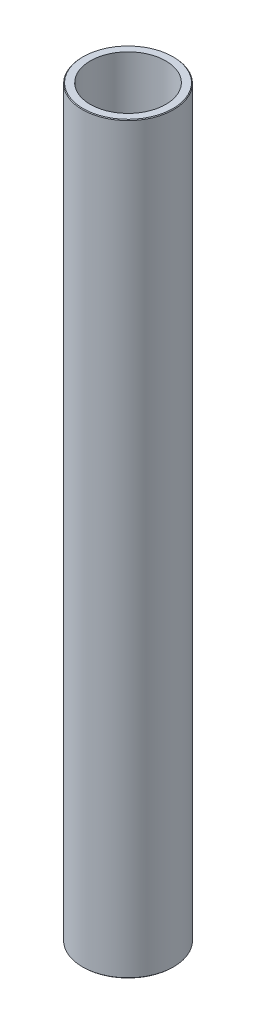
ISO-10303-21;
HEADER;
FILE_DESCRIPTION(('STEP AP214'),'2;1');
FILE_NAME('part.step','',(''),(''),'','','');
FILE_SCHEMA(('AUTOMOTIVE_DESIGN { 1 0 10303 214 1 1 1 1 }'));
ENDSEC;
DATA;
#1=APPLICATION_CONTEXT('core data for automotive mechanical design processes');
#2=APPLICATION_PROTOCOL_DEFINITION('international standard','automotive_design',2000,#1);
#3=PRODUCT_CONTEXT('',#1,'mechanical');
#4=PRODUCT('Part','Part','',(#3));
#5=PRODUCT_RELATED_PRODUCT_CATEGORY('part','',(#4));
#6=PRODUCT_DEFINITION_FORMATION('','',#4);
#7=PRODUCT_DEFINITION_CONTEXT('part definition',#1,'design');
#8=PRODUCT_DEFINITION('design','',#6,#7);
#9=PRODUCT_DEFINITION_SHAPE('','',#8);
#10=(LENGTH_UNIT() NAMED_UNIT(*) SI_UNIT(.MILLI.,.METRE.));
#11=(NAMED_UNIT(*) PLANE_ANGLE_UNIT() SI_UNIT($,.RADIAN.));
#12=(NAMED_UNIT(*) SI_UNIT($,.STERADIAN.) SOLID_ANGLE_UNIT());
#13=UNCERTAINTY_MEASURE_WITH_UNIT(LENGTH_MEASURE(1.E-05),#10,'distance_accuracy_value','');
#14=(GEOMETRIC_REPRESENTATION_CONTEXT(3) GLOBAL_UNCERTAINTY_ASSIGNED_CONTEXT((#13)) GLOBAL_UNIT_ASSIGNED_CONTEXT((#10,
#11,#12)) REPRESENTATION_CONTEXT('',''));
#15=CARTESIAN_POINT('',(0.,0.,0.));
#16=DIRECTION('',(0.,0.,1.));
#17=DIRECTION('',(1.,0.,0.));
#18=AXIS2_PLACEMENT_3D('',#15,#16,#17);
#19=CARTESIAN_POINT('',(0.,530.269863304996,0.));
#20=DIRECTION('',(0.,-1.,0.));
#21=DIRECTION('',(0.,0.,-1.));
#22=AXIS2_PLACEMENT_3D('',#19,#20,#21);
#23=CYLINDRICAL_SURFACE('',#22,32.5);
#24=CARTESIAN_POINT('',(0.,529.795413473299,0.));
#25=DIRECTION('',(0.,1.,0.));
#26=DIRECTION('',(0.,0.,1.));
#27=AXIS2_PLACEMENT_3D('',#24,#25,#26);
#28=CIRCLE('',#27,32.5);
#29=CARTESIAN_POINT('',(0.,529.795413473299,-32.5));
#30=VERTEX_POINT('',#29);
#31=EDGE_CURVE('E50',#30,#30,#28,.F.);
#32=CARTESIAN_POINT('',(0.,0.474449831697088,0.));
#33=DIRECTION('',(0.,1.,0.));
#34=DIRECTION('',(0.,0.,1.));
#35=AXIS2_PLACEMENT_3D('',#32,#33,#34);
#36=CIRCLE('',#35,32.5);
#37=CARTESIAN_POINT('',(0.,0.474449831697088,-32.5));
#38=VERTEX_POINT('',#37);
#39=EDGE_CURVE('E51',#38,#38,#36,.T.);
#40=CARTESIAN_POINT('',(0.,529.795413473299,-32.5));
#41=CARTESIAN_POINT('',(0.,524.281653435365,-32.5));
#42=CARTESIAN_POINT('',(0.,518.767893397432,-32.5));
#43=CARTESIAN_POINT('',(0.,507.740373321565,-32.5));
#44=CARTESIAN_POINT('',(0.,502.226613283632,-32.5));
#45=CARTESIAN_POINT('',(0.,491.199093207765,-32.5));
#46=CARTESIAN_POINT('',(0.,485.685333169832,-32.5));
#47=CARTESIAN_POINT('',(0.,474.657813093965,-32.5));
#48=CARTESIAN_POINT('',(0.,469.144053056032,-32.5));
#49=CARTESIAN_POINT('',(0.,458.116532980165,-32.5));
#50=CARTESIAN_POINT('',(0.,452.602772942232,-32.5));
#51=CARTESIAN_POINT('',(0.,441.575252866365,-32.5));
#52=CARTESIAN_POINT('',(0.,436.061492828432,-32.5));
#53=CARTESIAN_POINT('',(0.,425.033972752565,-32.5));
#54=CARTESIAN_POINT('',(0.,419.520212714632,-32.5));
#55=CARTESIAN_POINT('',(0.,408.492692638765,-32.5));
#56=CARTESIAN_POINT('',(0.,402.978932600832,-32.5));
#57=CARTESIAN_POINT('',(0.,391.951412524965,-32.5));
#58=CARTESIAN_POINT('',(0.,386.437652487032,-32.5));
#59=CARTESIAN_POINT('',(0.,375.410132411165,-32.5));
#60=CARTESIAN_POINT('',(0.,369.896372373232,-32.5));
#61=CARTESIAN_POINT('',(0.,358.868852297365,-32.5));
#62=CARTESIAN_POINT('',(0.,353.355092259431,-32.5));
#63=CARTESIAN_POINT('',(0.,342.327572183565,-32.5));
#64=CARTESIAN_POINT('',(0.,336.813812145631,-32.5));
#65=CARTESIAN_POINT('',(0.,325.786292069765,-32.5));
#66=CARTESIAN_POINT('',(0.,320.272532031831,-32.5));
#67=CARTESIAN_POINT('',(0.,309.245011955965,-32.5));
#68=CARTESIAN_POINT('',(0.,303.731251918031,-32.5));
#69=CARTESIAN_POINT('',(0.,292.703731842165,-32.5));
#70=CARTESIAN_POINT('',(0.,287.189971804231,-32.5));
#71=CARTESIAN_POINT('',(0.,276.162451728364,-32.5));
#72=CARTESIAN_POINT('',(0.,270.648691690431,-32.5));
#73=CARTESIAN_POINT('',(0.,259.621171614565,-32.5));
#74=CARTESIAN_POINT('',(0.,254.107411576631,-32.5));
#75=CARTESIAN_POINT('',(0.,243.079891500764,-32.5));
#76=CARTESIAN_POINT('',(0.,237.566131462831,-32.5));
#77=CARTESIAN_POINT('',(0.,226.538611386964,-32.5));
#78=CARTESIAN_POINT('',(0.,221.024851349031,-32.5));
#79=CARTESIAN_POINT('',(0.,209.997331273164,-32.5));
#80=CARTESIAN_POINT('',(0.,204.483571235231,-32.5));
#81=CARTESIAN_POINT('',(0.,193.456051159364,-32.5));
#82=CARTESIAN_POINT('',(0.,187.942291121431,-32.5));
#83=CARTESIAN_POINT('',(0.,176.914771045564,-32.5));
#84=CARTESIAN_POINT('',(0.,171.401011007631,-32.5));
#85=CARTESIAN_POINT('',(0.,160.373490931764,-32.5));
#86=CARTESIAN_POINT('',(0.,154.859730893831,-32.5));
#87=CARTESIAN_POINT('',(0.,143.832210817964,-32.5));
#88=CARTESIAN_POINT('',(0.,138.318450780031,-32.5));
#89=CARTESIAN_POINT('',(0.,127.290930704164,-32.5));
#90=CARTESIAN_POINT('',(0.,121.777170666231,-32.5));
#91=CARTESIAN_POINT('',(0.,110.749650590364,-32.5));
#92=CARTESIAN_POINT('',(0.,105.235890552431,-32.5));
#93=CARTESIAN_POINT('',(0.,94.208370476564,-32.5));
#94=CARTESIAN_POINT('',(0.,88.6946104386306,-32.5));
#95=CARTESIAN_POINT('',(0.,77.6670903627639,-32.5));
#96=CARTESIAN_POINT('',(0.,72.1533303248306,-32.5));
#97=CARTESIAN_POINT('',(0.,61.1258102489639,-32.5));
#98=CARTESIAN_POINT('',(0.,55.6120502110305,-32.5));
#99=CARTESIAN_POINT('',(0.,44.5845301351638,-32.5));
#100=CARTESIAN_POINT('',(0.,39.0707700972305,-32.5));
#101=CARTESIAN_POINT('',(0.,28.0432500213638,-32.5));
#102=CARTESIAN_POINT('',(0.,22.5294899834305,-32.5));
#103=CARTESIAN_POINT('',(0.,11.5019699075638,-32.5));
#104=CARTESIAN_POINT('',(0.,5.98820986963045,-32.5));
#105=CARTESIAN_POINT('',(0.,0.474449831697088,-32.5));
#106=B_SPLINE_CURVE_WITH_KNOTS('',3,(#40,#41,#42,#43,#44,#45,#46,#47,#48,#49,#50,#51,#52,#53,
#54,#55,#56,#57,#58,#59,#60,#61,#62,#63,#64,#65,#66,#67,#68,#69,#70,#71,#72,#73,#74,#75,#76,#77,
#78,#79,#80,#81,#82,#83,#84,#85,#86,#87,#88,#89,#90,#91,#92,#93,#94,#95,#96,#97,#98,#99,#100,
#101,#102,#103,#104,#105),.UNSPECIFIED.,.F.,.F.,(4,2,2,2,2,2,2,2,2,2,2,2,2,2,2,2,2,2,2,2,2,2,2,
2,2,2,2,2,2,2,2,2,4),(0.,16.5412801138001,33.0825602276001,49.6238403414002,66.1651204552003,
82.7064005690003,99.2476806828004,115.7889607966,132.3302409104,148.871521024201,
165.412801138001,181.954081251801,198.495361365601,215.036641479401,231.577921593201,
248.119201707001,264.660481820801,281.201761934601,297.743042048401,314.284322162201,
330.825602276001,347.366882389801,363.908162503601,380.449442617401,396.990722731201,
413.532002845001,430.073282958801,446.614563072601,463.155843186402,479.697123300202,
496.238403414002,512.779683527802,529.320963641602),.UNSPECIFIED.);
#107=EDGE_CURVE('BSEAM39',#30,#38,#106,.T.);
#108=ORIENTED_EDGE('',*,*,#31,.T.);
#109=ORIENTED_EDGE('',*,*,#39,.T.);
#110=ORIENTED_EDGE('',*,*,#107,.T.);
#111=ORIENTED_EDGE('',*,*,#107,.F.);
#112=EDGE_LOOP('',(#108,#110,#109,#111));
#113=FACE_BOUND('',#112,.T.);
#114=ADVANCED_FACE('F39',(#113),#23,.T.);
#115=CARTESIAN_POINT('',(0.,530.269863304996,0.));
#116=DIRECTION('',(0.,1.,0.));
#117=DIRECTION('',(0.,0.,1.));
#118=AXIS2_PLACEMENT_3D('',#115,#116,#117);
#119=PLANE('',#118);
#120=CARTESIAN_POINT('',(0.,530.269863304996,0.));
#121=DIRECTION('',(0.,1.,0.));
#122=DIRECTION('',(0.,0.,1.));
#123=AXIS2_PLACEMENT_3D('',#120,#121,#122);
#124=CIRCLE('',#123,32.025550168303);
#125=CARTESIAN_POINT('',(0.,530.269863304996,-32.025550168303));
#126=VERTEX_POINT('',#125);
#127=EDGE_CURVE('E54',#126,#126,#124,.T.);
#128=ORIENTED_EDGE('',*,*,#127,.T.);
#129=EDGE_LOOP('',(#128));
#130=FACE_BOUND('',#129,.T.);
#131=CARTESIAN_POINT('',(0.,530.269863304996,0.));
#132=DIRECTION('',(0.,1.,0.));
#133=DIRECTION('',(0.,0.,1.));
#134=AXIS2_PLACEMENT_3D('',#131,#132,#133);
#135=CIRCLE('',#134,26.9142500853023);
#136=CARTESIAN_POINT('',(0.,530.269863304996,26.9142500853023));
#137=VERTEX_POINT('',#136);
#138=EDGE_CURVE('E58',#137,#137,#135,.T.);
#139=ORIENTED_EDGE('',*,*,#138,.F.);
#140=EDGE_LOOP('',(#139));
#141=FACE_BOUND('',#140,.T.);
#142=ADVANCED_FACE('F69',(#130,#141),#119,.T.);
#143=CARTESIAN_POINT('',(0.,0.,0.));
#144=DIRECTION('',(0.,1.,0.));
#145=DIRECTION('',(0.,0.,1.));
#146=AXIS2_PLACEMENT_3D('',#143,#144,#145);
#147=PLANE('',#146);
#148=CARTESIAN_POINT('',(0.,0.,0.));
#149=DIRECTION('',(0.,1.,0.));
#150=DIRECTION('',(0.,0.,1.));
#151=AXIS2_PLACEMENT_3D('',#148,#149,#150);
#152=CIRCLE('',#151,32.0255501683029);
#153=CARTESIAN_POINT('',(0.,0.,32.0255501683029));
#154=VERTEX_POINT('',#153);
#155=EDGE_CURVE('E10',#154,#154,#152,.F.);
#156=ORIENTED_EDGE('',*,*,#155,.T.);
#157=EDGE_LOOP('',(#156));
#158=FACE_BOUND('',#157,.T.);
#159=CARTESIAN_POINT('',(0.,0.,0.));
#160=DIRECTION('',(0.,1.,0.));
#161=DIRECTION('',(0.,0.,1.));
#162=AXIS2_PLACEMENT_3D('',#159,#160,#161);
#163=CIRCLE('',#162,26.9142500853023);
#164=CARTESIAN_POINT('',(0.,0.,26.9142500853023));
#165=VERTEX_POINT('',#164);
#166=EDGE_CURVE('E63',#165,#165,#163,.T.);
#167=ORIENTED_EDGE('',*,*,#166,.T.);
#168=EDGE_LOOP('',(#167));
#169=FACE_BOUND('',#168,.T.);
#170=ADVANCED_FACE('F75',(#158,#169),#147,.F.);
#171=CARTESIAN_POINT('',(0.,530.269863304996,0.));
#172=DIRECTION('',(0.,-1.,0.));
#173=DIRECTION('',(0.,0.,-1.));
#174=AXIS2_PLACEMENT_3D('',#171,#172,#173);
#175=CYLINDRICAL_SURFACE('',#174,26.9142500853023);
#176=ORIENTED_EDGE('',*,*,#138,.T.);
#177=EDGE_LOOP('',(#176));
#178=FACE_BOUND('',#177,.T.);
#179=ORIENTED_EDGE('',*,*,#166,.F.);
#180=EDGE_LOOP('',(#179));
#181=FACE_BOUND('',#180,.T.);
#182=ADVANCED_FACE('F70',(#178,#181),#175,.F.);
#183=CARTESIAN_POINT('',(0.,530.269863304996,0.));
#184=DIRECTION('',(0.,-1.,0.));
#185=DIRECTION('',(0.,0.,-1.));
#186=AXIS2_PLACEMENT_3D('',#183,#184,#185);
#187=CONICAL_SURFACE('',#186,32.025550168303,0.785398163397361);
#188=CARTESIAN_POINT('',(0.,529.795413473299,-32.5000000000001));
#189=CARTESIAN_POINT('',(0.,529.800355659046,-32.4950578142532));
#190=CARTESIAN_POINT('',(0.,529.805297844792,-32.4901156285064));
#191=CARTESIAN_POINT('',(0.,529.815182216286,-32.4802312570127));
#192=CARTESIAN_POINT('',(0.,529.820124402033,-32.4752890712658));
#193=CARTESIAN_POINT('',(0.,529.830008773527,-32.4654046997721));
#194=CARTESIAN_POINT('',(0.,529.834950959273,-32.4604625140253));
#195=CARTESIAN_POINT('',(0.,529.844835330767,-32.4505781425316));
#196=CARTESIAN_POINT('',(0.,529.849777516514,-32.4456359567848));
#197=CARTESIAN_POINT('',(0.,529.859661888008,-32.4357515852911));
#198=CARTESIAN_POINT('',(0.,529.864604073754,-32.4308093995443));
#199=CARTESIAN_POINT('',(0.,529.874488445248,-32.4209250280506));
#200=CARTESIAN_POINT('',(0.,529.879430630995,-32.4159828423037));
#201=CARTESIAN_POINT('',(0.,529.889315002489,-32.40609847081));
#202=CARTESIAN_POINT('',(0.,529.894257188236,-32.4011562850632));
#203=CARTESIAN_POINT('',(0.,529.904141559729,-32.3912719135695));
#204=CARTESIAN_POINT('',(0.,529.909083745476,-32.3863297278227));
#205=CARTESIAN_POINT('',(0.,529.91896811697,-32.376445356329));
#206=CARTESIAN_POINT('',(0.,529.923910302717,-32.3715031705821));
#207=CARTESIAN_POINT('',(0.,529.93379467421,-32.3616187990884));
#208=CARTESIAN_POINT('',(0.,529.938736859957,-32.3566766133416));
#209=CARTESIAN_POINT('',(0.,529.948621231451,-32.3467922418479));
#210=CARTESIAN_POINT('',(0.,529.953563417198,-32.3418500561011));
#211=CARTESIAN_POINT('',(0.,529.963447788691,-32.3319656846074));
#212=CARTESIAN_POINT('',(0.,529.968389974438,-32.3270234988605));
#213=CARTESIAN_POINT('',(0.,529.978274345932,-32.3171391273668));
#214=CARTESIAN_POINT('',(0.,529.983216531679,-32.31219694162));
#215=CARTESIAN_POINT('',(0.,529.993100903172,-32.3023125701263));
#216=CARTESIAN_POINT('',(0.,529.998043088919,-32.2973703843795));
#217=CARTESIAN_POINT('',(0.,530.007927460413,-32.2874860128858));
#218=CARTESIAN_POINT('',(0.,530.01286964616,-32.2825438271389));
#219=CARTESIAN_POINT('',(0.,530.022754017653,-32.2726594556452));
#220=CARTESIAN_POINT('',(0.,530.0276962034,-32.2677172698984));
#221=CARTESIAN_POINT('',(0.,530.037580574894,-32.2578328984047));
#222=CARTESIAN_POINT('',(0.,530.042522760641,-32.2528907126579));
#223=CARTESIAN_POINT('',(0.,530.052407132135,-32.2430063411642));
#224=CARTESIAN_POINT('',(0.,530.057349317881,-32.2380641554173));
#225=CARTESIAN_POINT('',(0.,530.067233689375,-32.2281797839236));
#226=CARTESIAN_POINT('',(0.,530.072175875122,-32.2232375981768));
#227=CARTESIAN_POINT('',(0.,530.082060246616,-32.2133532266831));
#228=CARTESIAN_POINT('',(0.,530.087002432363,-32.2084110409363));
#229=CARTESIAN_POINT('',(0.,530.096886803856,-32.1985266694426));
#230=CARTESIAN_POINT('',(0.,530.101828989603,-32.1935844836957));
#231=CARTESIAN_POINT('',(0.,530.111713361097,-32.183700112202));
#232=CARTESIAN_POINT('',(0.,530.116655546844,-32.1787579264552));
#233=CARTESIAN_POINT('',(0.,530.126539918337,-32.1688735549615));
#234=CARTESIAN_POINT('',(0.,530.131482104084,-32.1639313692147));
#235=CARTESIAN_POINT('',(0.,530.141366475578,-32.154046997721));
#236=CARTESIAN_POINT('',(0.,530.146308661325,-32.1491048119742));
#237=CARTESIAN_POINT('',(0.,530.156193032818,-32.1392204404805));
#238=CARTESIAN_POINT('',(0.,530.161135218565,-32.1342782547336));
#239=CARTESIAN_POINT('',(0.,530.171019590059,-32.1243938832399));
#240=CARTESIAN_POINT('',(0.,530.175961775806,-32.1194516974931));
#241=CARTESIAN_POINT('',(0.,530.185846147299,-32.1095673259994));
#242=CARTESIAN_POINT('',(0.,530.190788333046,-32.1046251402526));
#243=CARTESIAN_POINT('',(0.,530.20067270454,-32.0947407687589));
#244=CARTESIAN_POINT('',(0.,530.205614890287,-32.089798583012));
#245=CARTESIAN_POINT('',(0.,530.21549926178,-32.0799142115183));
#246=CARTESIAN_POINT('',(0.,530.220441447527,-32.0749720257715));
#247=CARTESIAN_POINT('',(0.,530.230325819021,-32.0650876542778));
#248=CARTESIAN_POINT('',(0.,530.235268004768,-32.060145468531));
#249=CARTESIAN_POINT('',(0.,530.245152376262,-32.0502610970373));
#250=CARTESIAN_POINT('',(0.,530.250094562008,-32.0453189112904));
#251=CARTESIAN_POINT('',(0.,530.259978933502,-32.0354345397967));
#252=CARTESIAN_POINT('',(0.,530.264921119249,-32.0304923540499));
#253=CARTESIAN_POINT('',(0.,530.269863304996,-32.025550168303));
#254=B_SPLINE_CURVE_WITH_KNOTS('',3,(#188,#189,#190,#191,#192,#193,#194,#195,#196,#197,#198,
#199,#200,#201,#202,#203,#204,#205,#206,#207,#208,#209,#210,#211,#212,#213,#214,#215,#216,#217,
#218,#219,#220,#221,#222,#223,#224,#225,#226,#227,#228,#229,#230,#231,#232,#233,#234,#235,#236,
#237,#238,#239,#240,#241,#242,#243,#244,#245,#246,#247,#248,#249,#250,#251,#252,#253),
.UNSPECIFIED.,.F.,.F.,(4,2,2,2,2,2,2,2,2,2,2,2,2,2,2,2,2,2,2,2,2,2,2,2,2,2,2,2,2,2,2,2,4),(0.,
0.0209679183329182,0.0419358366657529,0.0629037549985926,0.0838716733315058,0.104839591664345,
0.125807509997185,0.146775428330098,0.167743346662938,0.188711264995778,0.209679183328691,
0.230647101661531,0.251615019994365,0.272582938327284,0.293550856660123,0.314518774992958,
0.335486693325798,0.356454611658716,0.377422529991551,0.39839044832439,0.419358366657303,
0.440326284990143,0.461294203322983,0.482262121655896,0.503230039988736,0.524197958321575,
0.545165876654489,0.566133794987328,0.587101713320168,0.608069631653081,0.629037549985921,
0.650005468318756,0.670973386651674),.UNSPECIFIED.);
#255=EDGE_CURVE('BSEAM81',#30,#126,#254,.T.);
#256=ORIENTED_EDGE('',*,*,#31,.F.);
#257=ORIENTED_EDGE('',*,*,#127,.F.);
#258=ORIENTED_EDGE('',*,*,#255,.T.);
#259=ORIENTED_EDGE('',*,*,#255,.F.);
#260=EDGE_LOOP('',(#256,#258,#257,#259));
#261=FACE_BOUND('',#260,.T.);
#262=ADVANCED_FACE('F81',(#261),#187,.T.);
#263=CARTESIAN_POINT('',(0.,0.474449831697088,0.));
#264=DIRECTION('',(0.,1.,0.));
#265=DIRECTION('',(0.,0.,1.));
#266=AXIS2_PLACEMENT_3D('',#263,#264,#265);
#267=CONICAL_SURFACE('',#266,32.5,0.785398163397478);
#268=ORIENTED_EDGE('',*,*,#155,.F.);
#269=EDGE_LOOP('',(#268));
#270=FACE_BOUND('',#269,.T.);
#271=ORIENTED_EDGE('',*,*,#39,.F.);
#272=EDGE_LOOP('',(#271));
#273=FACE_BOUND('',#272,.T.);
#274=ADVANCED_FACE('F45',(#270,#273),#267,.T.);
#275=CLOSED_SHELL('',(#114,#142,#170,#182,#262,#274));
#276=MANIFOLD_SOLID_BREP('B2',#275);
#277=ADVANCED_BREP_SHAPE_REPRESENTATION('',(#18,#276),#14);
#278=SHAPE_DEFINITION_REPRESENTATION(#9,#277);
ENDSEC;
END-ISO-10303-21;
